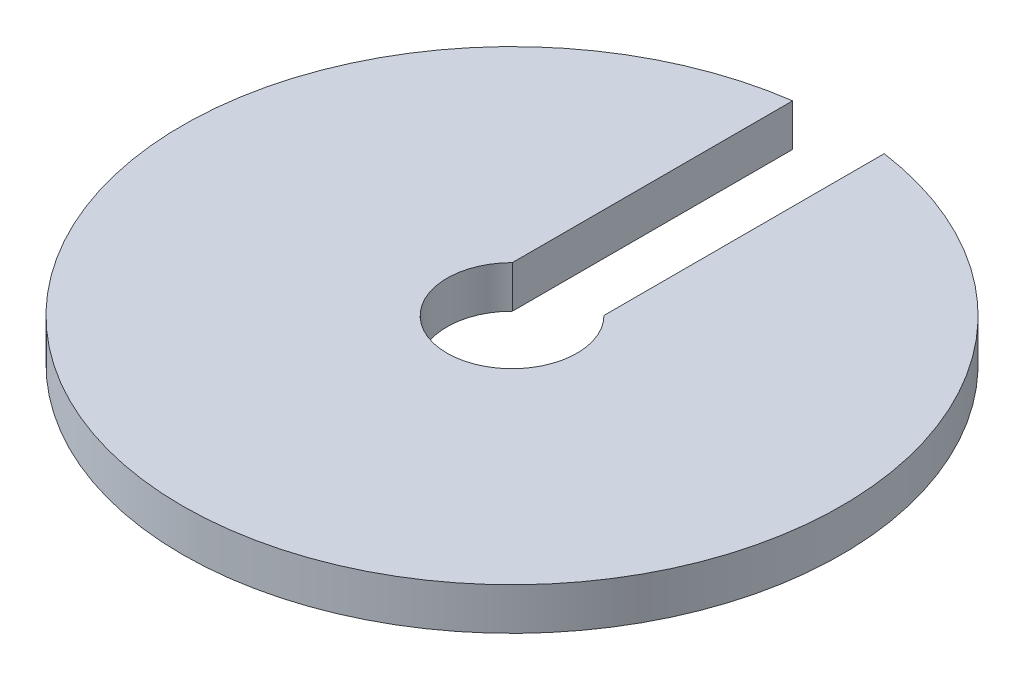
ISO-10303-21;
HEADER;
FILE_DESCRIPTION(('STEP AP214'),'2;1');
FILE_NAME('part.step','',(''),(''),'','','');
FILE_SCHEMA(('AUTOMOTIVE_DESIGN { 1 0 10303 214 1 1 1 1 }'));
ENDSEC;
DATA;
#1=APPLICATION_CONTEXT('core data for automotive mechanical design processes');
#2=APPLICATION_PROTOCOL_DEFINITION('international standard','automotive_design',2000,#1);
#3=PRODUCT_CONTEXT('',#1,'mechanical');
#4=PRODUCT('Part','Part','',(#3));
#5=PRODUCT_RELATED_PRODUCT_CATEGORY('part','',(#4));
#6=PRODUCT_DEFINITION_FORMATION('','',#4);
#7=PRODUCT_DEFINITION_CONTEXT('part definition',#1,'design');
#8=PRODUCT_DEFINITION('design','',#6,#7);
#9=PRODUCT_DEFINITION_SHAPE('','',#8);
#10=(LENGTH_UNIT() NAMED_UNIT(*) SI_UNIT(.MILLI.,.METRE.));
#11=(NAMED_UNIT(*) PLANE_ANGLE_UNIT() SI_UNIT($,.RADIAN.));
#12=(NAMED_UNIT(*) SI_UNIT($,.STERADIAN.) SOLID_ANGLE_UNIT());
#13=UNCERTAINTY_MEASURE_WITH_UNIT(LENGTH_MEASURE(1.E-05),#10,'distance_accuracy_value','');
#14=(GEOMETRIC_REPRESENTATION_CONTEXT(3) GLOBAL_UNCERTAINTY_ASSIGNED_CONTEXT((#13)) GLOBAL_UNIT_ASSIGNED_CONTEXT((#10,
#11,#12)) REPRESENTATION_CONTEXT('',''));
#15=CARTESIAN_POINT('',(0.,0.,0.));
#16=DIRECTION('',(0.,0.,1.));
#17=DIRECTION('',(1.,0.,0.));
#18=AXIS2_PLACEMENT_3D('',#15,#16,#17);
#19=CARTESIAN_POINT('',(0.,2.3,0.));
#20=DIRECTION('',(0.,-1.,0.));
#21=DIRECTION('',(0.,0.,-1.));
#22=AXIS2_PLACEMENT_3D('',#19,#20,#21);
#23=CYLINDRICAL_SURFACE('',#22,3.55);
#24=CARTESIAN_POINT('',(0.,0.,0.));
#25=DIRECTION('',(0.,-1.,0.));
#26=DIRECTION('',(0.,0.,1.));
#27=AXIS2_PLACEMENT_3D('',#24,#25,#26);
#28=CIRCLE('',#27,3.55);
#29=CARTESIAN_POINT('',(2.5,0.,-2.52041663222571));
#30=VERTEX_POINT('',#29);
#31=CARTESIAN_POINT('',(-2.5,0.,-2.52041663222571));
#32=VERTEX_POINT('',#31);
#33=EDGE_CURVE('E113',#30,#32,#28,.T.);
#34=ORIENTED_EDGE('',*,*,#33,.T.);
#35=DIRECTION('',(0.,-1.,0.));
#36=VECTOR('',#35,1.);
#37=CARTESIAN_POINT('',(-2.5,2.3,-2.52041663222571));
#38=LINE('',#37,#36);
#39=CARTESIAN_POINT('',(-2.5,2.3,-2.52041663222571));
#40=VERTEX_POINT('',#39);
#41=EDGE_CURVE('E11',#40,#32,#38,.T.);
#42=ORIENTED_EDGE('',*,*,#41,.F.);
#43=CARTESIAN_POINT('',(0.,2.3,0.));
#44=DIRECTION('',(0.,-1.,0.));
#45=DIRECTION('',(0.,0.,1.));
#46=AXIS2_PLACEMENT_3D('',#43,#44,#45);
#47=CIRCLE('',#46,3.55);
#48=CARTESIAN_POINT('',(2.5,2.3,-2.52041663222571));
#49=VERTEX_POINT('',#48);
#50=EDGE_CURVE('E97',#49,#40,#47,.T.);
#51=ORIENTED_EDGE('',*,*,#50,.F.);
#52=DIRECTION('',(0.,-1.,0.));
#53=VECTOR('',#52,1.);
#54=CARTESIAN_POINT('',(2.5,2.3,-2.52041663222571));
#55=LINE('',#54,#53);
#56=EDGE_CURVE('E109',#49,#30,#55,.T.);
#57=ORIENTED_EDGE('',*,*,#56,.T.);
#58=EDGE_LOOP('',(#34,#42,#51,#57));
#59=FACE_BOUND('',#58,.T.);
#60=ADVANCED_FACE('F45',(#59),#23,.F.);
#61=CARTESIAN_POINT('',(-2.5,2.3,-2.52041663222571));
#62=DIRECTION('',(-1.,0.,0.));
#63=DIRECTION('',(0.,0.,1.));
#64=AXIS2_PLACEMENT_3D('',#61,#62,#63);
#65=PLANE('',#64);
#66=DIRECTION('',(0.,0.,-1.));
#67=VECTOR('',#66,1.);
#68=CARTESIAN_POINT('',(-2.5,0.,-2.52041663222571));
#69=LINE('',#68,#67);
#70=CARTESIAN_POINT('',(-2.5,0.,-17.8255434699759));
#71=VERTEX_POINT('',#70);
#72=EDGE_CURVE('E102',#32,#71,#69,.T.);
#73=ORIENTED_EDGE('',*,*,#72,.T.);
#74=DIRECTION('',(0.,-1.,0.));
#75=VECTOR('',#74,1.);
#76=CARTESIAN_POINT('',(-2.5,2.3,-17.8255434699759));
#77=LINE('',#76,#75);
#78=CARTESIAN_POINT('',(-2.5,2.3,-17.8255434699759));
#79=VERTEX_POINT('',#78);
#80=EDGE_CURVE('E54',#79,#71,#77,.T.);
#81=ORIENTED_EDGE('',*,*,#80,.F.);
#82=DIRECTION('',(0.,0.,-1.));
#83=VECTOR('',#82,1.);
#84=CARTESIAN_POINT('',(-2.5,2.3,-2.52041663222571));
#85=LINE('',#84,#83);
#86=EDGE_CURVE('E92',#40,#79,#85,.T.);
#87=ORIENTED_EDGE('',*,*,#86,.F.);
#88=ORIENTED_EDGE('',*,*,#41,.T.);
#89=EDGE_LOOP('',(#73,#81,#87,#88));
#90=FACE_BOUND('',#89,.T.);
#91=ADVANCED_FACE('F101',(#90),#65,.F.);
#92=CARTESIAN_POINT('',(0.,2.3,0.));
#93=DIRECTION('',(0.,-1.,0.));
#94=DIRECTION('',(0.,0.,-1.));
#95=AXIS2_PLACEMENT_3D('',#92,#93,#94);
#96=CYLINDRICAL_SURFACE('',#95,18.);
#97=CARTESIAN_POINT('',(0.,0.,0.));
#98=DIRECTION('',(0.,1.,0.));
#99=DIRECTION('',(0.,0.,1.));
#100=AXIS2_PLACEMENT_3D('',#97,#98,#99);
#101=CIRCLE('',#100,18.);
#102=CARTESIAN_POINT('',(2.50000000000001,0.,-17.8255434699759));
#103=VERTEX_POINT('',#102);
#104=EDGE_CURVE('E79',#71,#103,#101,.T.);
#105=ORIENTED_EDGE('',*,*,#104,.T.);
#106=DIRECTION('',(0.,-1.,0.));
#107=VECTOR('',#106,1.);
#108=CARTESIAN_POINT('',(2.50000000000001,2.3,-17.8255434699759));
#109=LINE('',#108,#107);
#110=CARTESIAN_POINT('',(2.50000000000001,2.3,-17.8255434699759));
#111=VERTEX_POINT('',#110);
#112=EDGE_CURVE('E104',#111,#103,#109,.T.);
#113=ORIENTED_EDGE('',*,*,#112,.F.);
#114=CARTESIAN_POINT('',(0.,2.3,0.));
#115=DIRECTION('',(0.,1.,0.));
#116=DIRECTION('',(0.,0.,1.));
#117=AXIS2_PLACEMENT_3D('',#114,#115,#116);
#118=CIRCLE('',#117,18.);
#119=EDGE_CURVE('E95',#79,#111,#118,.T.);
#120=ORIENTED_EDGE('',*,*,#119,.F.);
#121=ORIENTED_EDGE('',*,*,#80,.T.);
#122=EDGE_LOOP('',(#105,#113,#120,#121));
#123=FACE_BOUND('',#122,.T.);
#124=ADVANCED_FACE('F105',(#123),#96,.T.);
#125=CARTESIAN_POINT('',(2.5,2.3,-17.8255434699759));
#126=DIRECTION('',(1.,0.,0.));
#127=DIRECTION('',(0.,0.,-1.));
#128=AXIS2_PLACEMENT_3D('',#125,#126,#127);
#129=PLANE('',#128);
#130=DIRECTION('',(0.,0.,1.));
#131=VECTOR('',#130,1.);
#132=CARTESIAN_POINT('',(2.5,0.,-17.8255434699759));
#133=LINE('',#132,#131);
#134=EDGE_CURVE('E85',#103,#30,#133,.T.);
#135=ORIENTED_EDGE('',*,*,#134,.T.);
#136=ORIENTED_EDGE('',*,*,#56,.F.);
#137=DIRECTION('',(0.,0.,1.));
#138=VECTOR('',#137,1.);
#139=CARTESIAN_POINT('',(2.5,2.3,-17.8255434699759));
#140=LINE('',#139,#138);
#141=EDGE_CURVE('E62',#111,#49,#140,.T.);
#142=ORIENTED_EDGE('',*,*,#141,.F.);
#143=ORIENTED_EDGE('',*,*,#112,.T.);
#144=EDGE_LOOP('',(#135,#136,#142,#143));
#145=FACE_BOUND('',#144,.T.);
#146=ADVANCED_FACE('F126',(#145),#129,.F.);
#147=CARTESIAN_POINT('',(0.,2.3,0.));
#148=DIRECTION('',(0.,1.,0.));
#149=DIRECTION('',(0.,0.,1.));
#150=AXIS2_PLACEMENT_3D('',#147,#148,#149);
#151=PLANE('',#150);
#152=ORIENTED_EDGE('',*,*,#50,.T.);
#153=ORIENTED_EDGE('',*,*,#86,.T.);
#154=ORIENTED_EDGE('',*,*,#119,.T.);
#155=ORIENTED_EDGE('',*,*,#141,.T.);
#156=EDGE_LOOP('',(#152,#153,#154,#155));
#157=FACE_BOUND('',#156,.T.);
#158=ADVANCED_FACE('F93',(#157),#151,.T.);
#159=CARTESIAN_POINT('',(0.,0.,0.));
#160=DIRECTION('',(0.,1.,0.));
#161=DIRECTION('',(0.,0.,1.));
#162=AXIS2_PLACEMENT_3D('',#159,#160,#161);
#163=PLANE('',#162);
#164=ORIENTED_EDGE('',*,*,#33,.F.);
#165=ORIENTED_EDGE('',*,*,#134,.F.);
#166=ORIENTED_EDGE('',*,*,#104,.F.);
#167=ORIENTED_EDGE('',*,*,#72,.F.);
#168=EDGE_LOOP('',(#164,#165,#166,#167));
#169=FACE_BOUND('',#168,.T.);
#170=ADVANCED_FACE('F129',(#169),#163,.F.);
#171=CLOSED_SHELL('',(#60,#91,#124,#146,#158,#170));
#172=MANIFOLD_SOLID_BREP('B2',#171);
#173=ADVANCED_BREP_SHAPE_REPRESENTATION('',(#18,#172),#14);
#174=SHAPE_DEFINITION_REPRESENTATION(#9,#173);
ENDSEC;
END-ISO-10303-21;
